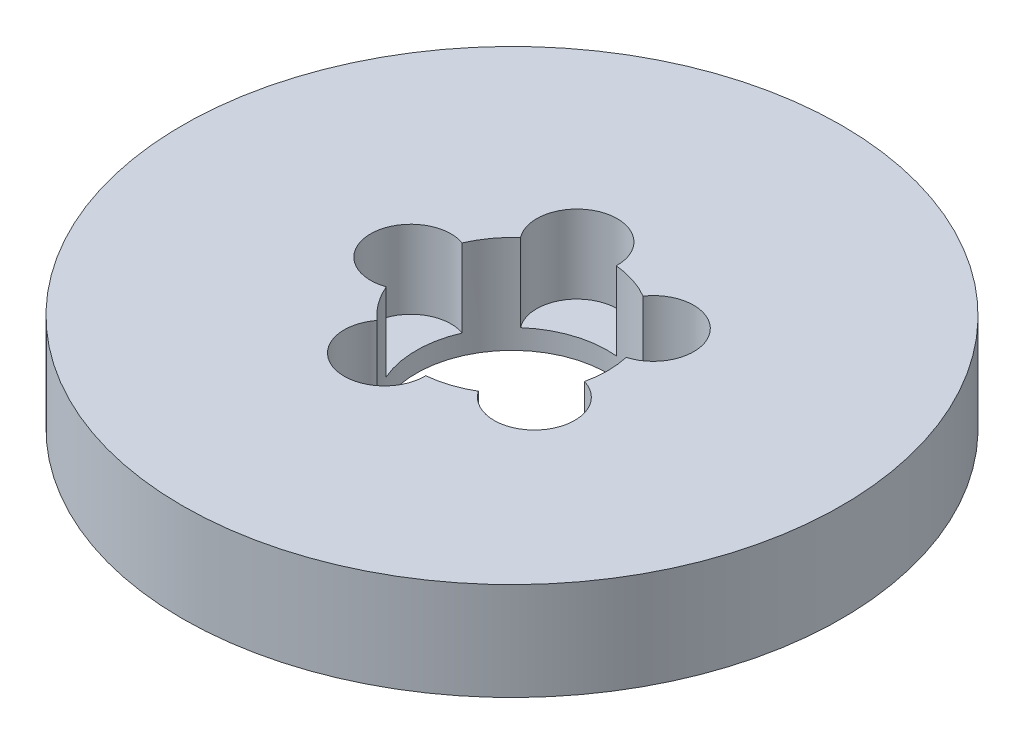
ISO-10303-21;
HEADER;
FILE_DESCRIPTION(('STEP AP214'),'2;1');
FILE_NAME('part.step','',(''),(''),'','','');
FILE_SCHEMA(('AUTOMOTIVE_DESIGN { 1 0 10303 214 1 1 1 1 }'));
ENDSEC;
DATA;
#1=APPLICATION_CONTEXT('core data for automotive mechanical design processes');
#2=APPLICATION_PROTOCOL_DEFINITION('international standard','automotive_design',2000,#1);
#3=PRODUCT_CONTEXT('',#1,'mechanical');
#4=PRODUCT('Part','Part','',(#3));
#5=PRODUCT_RELATED_PRODUCT_CATEGORY('part','',(#4));
#6=PRODUCT_DEFINITION_FORMATION('','',#4);
#7=PRODUCT_DEFINITION_CONTEXT('part definition',#1,'design');
#8=PRODUCT_DEFINITION('design','',#6,#7);
#9=PRODUCT_DEFINITION_SHAPE('','',#8);
#10=(LENGTH_UNIT() NAMED_UNIT(*) SI_UNIT(.MILLI.,.METRE.));
#11=(NAMED_UNIT(*) PLANE_ANGLE_UNIT() SI_UNIT($,.RADIAN.));
#12=(NAMED_UNIT(*) SI_UNIT($,.STERADIAN.) SOLID_ANGLE_UNIT());
#13=UNCERTAINTY_MEASURE_WITH_UNIT(LENGTH_MEASURE(1.E-05),#10,'distance_accuracy_value','');
#14=(GEOMETRIC_REPRESENTATION_CONTEXT(3) GLOBAL_UNCERTAINTY_ASSIGNED_CONTEXT((#13)) GLOBAL_UNIT_ASSIGNED_CONTEXT((#10,
#11,#12)) REPRESENTATION_CONTEXT('',''));
#15=CARTESIAN_POINT('',(0.,0.,0.));
#16=DIRECTION('',(0.,0.,1.));
#17=DIRECTION('',(1.,0.,0.));
#18=AXIS2_PLACEMENT_3D('',#15,#16,#17);
#19=CARTESIAN_POINT('',(0.,23.,0.));
#20=DIRECTION('',(0.,-1.,0.));
#21=DIRECTION('',(0.,0.,-1.));
#22=AXIS2_PLACEMENT_3D('',#19,#20,#21);
#23=CYLINDRICAL_SURFACE('',#22,77.5);
#24=CARTESIAN_POINT('',(0.,23.,0.));
#25=DIRECTION('',(0.,1.,0.));
#26=DIRECTION('',(0.,0.,1.));
#27=AXIS2_PLACEMENT_3D('',#24,#25,#26);
#28=CIRCLE('',#27,77.5);
#29=CARTESIAN_POINT('',(0.,23.,77.5));
#30=VERTEX_POINT('',#29);
#31=EDGE_CURVE('E157',#30,#30,#28,.T.);
#32=ORIENTED_EDGE('',*,*,#31,.F.);
#33=EDGE_LOOP('',(#32));
#34=FACE_BOUND('',#33,.T.);
#35=CARTESIAN_POINT('',(0.,0.,0.));
#36=DIRECTION('',(0.,1.,0.));
#37=DIRECTION('',(0.,0.,1.));
#38=AXIS2_PLACEMENT_3D('',#35,#36,#37);
#39=CIRCLE('',#38,77.5);
#40=CARTESIAN_POINT('',(0.,0.,77.5));
#41=VERTEX_POINT('',#40);
#42=EDGE_CURVE('E150',#41,#41,#39,.T.);
#43=ORIENTED_EDGE('',*,*,#42,.T.);
#44=EDGE_LOOP('',(#43));
#45=FACE_BOUND('',#44,.T.);
#46=ADVANCED_FACE('F39',(#34,#45),#23,.T.);
#47=CARTESIAN_POINT('',(0.,23.,0.));
#48=DIRECTION('',(0.,1.,0.));
#49=DIRECTION('',(0.,0.,1.));
#50=AXIS2_PLACEMENT_3D('',#47,#48,#49);
#51=PLANE('',#50);
#52=CARTESIAN_POINT('',(-7.3542074462386,23.,-22.6339231862593));
#53=DIRECTION('',(0.,1.,0.));
#54=DIRECTION('',(-0.95105651629515,0.,0.309016994374958));
#55=AXIS2_PLACEMENT_3D('',#52,#53,#54);
#56=CIRCLE('',#55,9.47849117084988);
#57=CARTESIAN_POINT('',(2.12139106793687,23.,-22.3997700866968));
#58=VERTEX_POINT('',#57);
#59=CARTESIAN_POINT('',(-14.882495937379,23.,-16.8748722861507));
#60=VERTEX_POINT('',#59);
#61=EDGE_CURVE('E194',#58,#60,#56,.T.);
#62=ORIENTED_EDGE('',*,*,#61,.F.);
#63=CARTESIAN_POINT('',(0.,23.,0.));
#64=DIRECTION('',(0.,1.,0.));
#65=DIRECTION('',(0.,0.,1.));
#66=AXIS2_PLACEMENT_3D('',#63,#64,#65);
#67=CIRCLE('',#66,22.5);
#68=CARTESIAN_POINT('',(11.450013086026,23.,-19.3687170543078));
#69=VERTEX_POINT('',#68);
#70=EDGE_CURVE('E147',#69,#58,#67,.T.);
#71=ORIENTED_EDGE('',*,*,#70,.F.);
#72=CARTESIAN_POINT('',(19.2535650545694,23.,-13.9885338278628));
#73=DIRECTION('',(0.,1.,0.));
#74=DIRECTION('',(-0.58778525229248,0.,-0.809016994374942));
#75=AXIS2_PLACEMENT_3D('',#72,#73,#74);
#76=CIRCLE('',#75,9.47849117084988);
#77=CARTESIAN_POINT('',(21.958993196174,23.,-4.90434682810916));
#78=VERTEX_POINT('',#77);
#79=EDGE_CURVE('E254',#78,#69,#76,.T.);
#80=ORIENTED_EDGE('',*,*,#79,.F.);
#81=CARTESIAN_POINT('',(21.9589931961741,23.,4.90434682810884));
#82=VERTEX_POINT('',#81);
#83=EDGE_CURVE('E144',#82,#78,#67,.T.);
#84=ORIENTED_EDGE('',*,*,#83,.F.);
#85=CARTESIAN_POINT('',(19.2535650545696,23.,13.9885338278625));
#86=DIRECTION('',(0.,1.,0.));
#87=DIRECTION('',(0.587785252292469,0.,-0.809016994374951));
#88=AXIS2_PLACEMENT_3D('',#85,#86,#87);
#89=CIRCLE('',#88,9.47849117084988);
#90=CARTESIAN_POINT('',(11.4500130860262,23.,19.3687170543077));
#91=VERTEX_POINT('',#90);
#92=EDGE_CURVE('E141',#91,#82,#89,.T.);
#93=ORIENTED_EDGE('',*,*,#92,.F.);
#94=CARTESIAN_POINT('',(2.12139106793718,23.,22.3997700866968));
#95=VERTEX_POINT('',#94);
#96=EDGE_CURVE('E134',#95,#91,#67,.T.);
#97=ORIENTED_EDGE('',*,*,#96,.F.);
#98=CARTESIAN_POINT('',(-7.35420744623828,23.,22.6339231862594));
#99=DIRECTION('',(0.,1.,0.));
#100=DIRECTION('',(0.951056516295155,0.,0.309016994374945));
#101=AXIS2_PLACEMENT_3D('',#98,#99,#100);
#102=CIRCLE('',#101,9.47849117084988);
#103=CARTESIAN_POINT('',(-14.8824959373788,23.,16.8748722861509));
#104=VERTEX_POINT('',#103);
#105=EDGE_CURVE('E111',#104,#95,#102,.T.);
#106=ORIENTED_EDGE('',*,*,#105,.F.);
#107=CARTESIAN_POINT('',(-20.6479014127585,23.,8.93947242565283));
#108=VERTEX_POINT('',#107);
#109=EDGE_CURVE('E145',#108,#104,#67,.T.);
#110=ORIENTED_EDGE('',*,*,#109,.F.);
#111=CARTESIAN_POINT('',(-23.7987152166624,23.,0.));
#112=DIRECTION('',(0.,1.,0.));
#113=DIRECTION('',(0.,0.,1.));
#114=AXIS2_PLACEMENT_3D('',#111,#112,#113);
#115=CIRCLE('',#114,9.47849117084988);
#116=CARTESIAN_POINT('',(-20.6479014127585,23.,-8.93947242565283));
#117=VERTEX_POINT('',#116);
#118=EDGE_CURVE('E153',#117,#108,#115,.T.);
#119=ORIENTED_EDGE('',*,*,#118,.F.);
#120=EDGE_CURVE('E146',#60,#117,#67,.T.);
#121=ORIENTED_EDGE('',*,*,#120,.F.);
#122=EDGE_LOOP('',(#62,#71,#80,#84,#93,#97,#106,#110,#119,#121));
#123=FACE_BOUND('',#122,.T.);
#124=ORIENTED_EDGE('',*,*,#31,.T.);
#125=EDGE_LOOP('',(#124));
#126=FACE_BOUND('',#125,.T.);
#127=ADVANCED_FACE('F139',(#123,#126),#51,.T.);
#128=CARTESIAN_POINT('',(0.,0.,0.));
#129=DIRECTION('',(0.,1.,0.));
#130=DIRECTION('',(0.,0.,1.));
#131=AXIS2_PLACEMENT_3D('',#128,#129,#130);
#132=PLANE('',#131);
#133=CARTESIAN_POINT('',(0.,0.,0.));
#134=DIRECTION('',(0.,1.,0.));
#135=DIRECTION('',(0.,0.,1.));
#136=AXIS2_PLACEMENT_3D('',#133,#134,#135);
#137=CIRCLE('',#136,22.5);
#138=CARTESIAN_POINT('',(0.,0.,22.5));
#139=VERTEX_POINT('',#138);
#140=EDGE_CURVE('E154',#139,#139,#137,.T.);
#141=ORIENTED_EDGE('',*,*,#140,.T.);
#142=EDGE_LOOP('',(#141));
#143=FACE_BOUND('',#142,.T.);
#144=ORIENTED_EDGE('',*,*,#42,.F.);
#145=EDGE_LOOP('',(#144));
#146=FACE_BOUND('',#145,.T.);
#147=ADVANCED_FACE('F213',(#143,#146),#132,.F.);
#148=CARTESIAN_POINT('',(0.,23.,0.));
#149=DIRECTION('',(0.,-1.,0.));
#150=DIRECTION('',(0.,0.,-1.));
#151=AXIS2_PLACEMENT_3D('',#148,#149,#150);
#152=CYLINDRICAL_SURFACE('',#151,22.5);
#153=DIRECTION('',(0.,1.,0.));
#154=VECTOR('',#153,1.);
#155=CARTESIAN_POINT('',(2.12139106793687,13.8272696008629,-22.3997700866968));
#156=LINE('',#155,#154);
#157=CARTESIAN_POINT('',(2.12139106793687,4.6545392017258,-22.3997700866968));
#158=VERTEX_POINT('',#157);
#159=EDGE_CURVE('E11',#158,#58,#156,.T.);
#160=ORIENTED_EDGE('',*,*,#159,.F.);
#161=CARTESIAN_POINT('',(0.,4.6545392017258,0.));
#162=DIRECTION('',(0.,1.,0.));
#163=DIRECTION('',(0.,0.,1.));
#164=AXIS2_PLACEMENT_3D('',#161,#162,#163);
#165=CIRCLE('',#164,22.5);
#166=CARTESIAN_POINT('',(-14.882495937379,4.6545392017258,-16.8748722861507));
#167=VERTEX_POINT('',#166);
#168=EDGE_CURVE('E189',#158,#167,#165,.T.);
#169=ORIENTED_EDGE('',*,*,#168,.T.);
#170=DIRECTION('',(0.,1.,0.));
#171=VECTOR('',#170,1.);
#172=CARTESIAN_POINT('',(-14.882495937379,13.8272696008629,-16.8748722861507));
#173=LINE('',#172,#171);
#174=EDGE_CURVE('E46',#60,#167,#173,.F.);
#175=ORIENTED_EDGE('',*,*,#174,.F.);
#176=ORIENTED_EDGE('',*,*,#120,.T.);
#177=DIRECTION('',(0.,1.,0.));
#178=VECTOR('',#177,1.);
#179=CARTESIAN_POINT('',(-20.6479014127585,13.8272696008629,-8.93947242565283));
#180=LINE('',#179,#178);
#181=CARTESIAN_POINT('',(-20.6479014127585,4.6545392017258,-8.93947242565283));
#182=VERTEX_POINT('',#181);
#183=EDGE_CURVE('E168',#182,#117,#180,.T.);
#184=ORIENTED_EDGE('',*,*,#183,.F.);
#185=CARTESIAN_POINT('',(0.,4.6545392017258,0.));
#186=DIRECTION('',(0.,1.,0.));
#187=DIRECTION('',(0.,0.,1.));
#188=AXIS2_PLACEMENT_3D('',#185,#186,#187);
#189=CIRCLE('',#188,22.5);
#190=CARTESIAN_POINT('',(-20.6479014127585,4.6545392017258,8.93947242565283));
#191=VERTEX_POINT('',#190);
#192=EDGE_CURVE('E165',#182,#191,#189,.T.);
#193=ORIENTED_EDGE('',*,*,#192,.T.);
#194=DIRECTION('',(0.,1.,0.));
#195=VECTOR('',#194,1.);
#196=CARTESIAN_POINT('',(-20.6479014127585,13.8272696008629,8.93947242565283));
#197=LINE('',#196,#195);
#198=EDGE_CURVE('E170',#108,#191,#197,.F.);
#199=ORIENTED_EDGE('',*,*,#198,.F.);
#200=ORIENTED_EDGE('',*,*,#109,.T.);
#201=DIRECTION('',(0.,1.,0.));
#202=VECTOR('',#201,1.);
#203=CARTESIAN_POINT('',(-14.8824959373788,13.8272696008629,16.8748722861509));
#204=LINE('',#203,#202);
#205=CARTESIAN_POINT('',(-14.8824959373788,4.6545392017258,16.8748722861509));
#206=VERTEX_POINT('',#205);
#207=EDGE_CURVE('E121',#206,#104,#204,.T.);
#208=ORIENTED_EDGE('',*,*,#207,.F.);
#209=CARTESIAN_POINT('',(0.,4.6545392017258,0.));
#210=DIRECTION('',(0.,1.,0.));
#211=DIRECTION('',(0.,0.,1.));
#212=AXIS2_PLACEMENT_3D('',#209,#210,#211);
#213=CIRCLE('',#212,22.5);
#214=CARTESIAN_POINT('',(2.12139106793718,4.6545392017258,22.3997700866968));
#215=VERTEX_POINT('',#214);
#216=EDGE_CURVE('E136',#206,#215,#213,.T.);
#217=ORIENTED_EDGE('',*,*,#216,.T.);
#218=DIRECTION('',(0.,1.,0.));
#219=VECTOR('',#218,1.);
#220=CARTESIAN_POINT('',(2.12139106793718,13.8272696008629,22.3997700866968));
#221=LINE('',#220,#219);
#222=EDGE_CURVE('E117',#95,#215,#221,.F.);
#223=ORIENTED_EDGE('',*,*,#222,.F.);
#224=ORIENTED_EDGE('',*,*,#96,.T.);
#225=DIRECTION('',(0.,1.,0.));
#226=VECTOR('',#225,1.);
#227=CARTESIAN_POINT('',(11.4500130860262,13.8272696008629,19.3687170543077));
#228=LINE('',#227,#226);
#229=CARTESIAN_POINT('',(11.4500130860262,4.6545392017258,19.3687170543077));
#230=VERTEX_POINT('',#229);
#231=EDGE_CURVE('E182',#230,#91,#228,.T.);
#232=ORIENTED_EDGE('',*,*,#231,.F.);
#233=CARTESIAN_POINT('',(0.,4.6545392017258,0.));
#234=DIRECTION('',(0.,1.,0.));
#235=DIRECTION('',(0.,0.,1.));
#236=AXIS2_PLACEMENT_3D('',#233,#234,#235);
#237=CIRCLE('',#236,22.5);
#238=CARTESIAN_POINT('',(21.9589931961741,4.6545392017258,4.90434682810884));
#239=VERTEX_POINT('',#238);
#240=EDGE_CURVE('E174',#230,#239,#237,.T.);
#241=ORIENTED_EDGE('',*,*,#240,.T.);
#242=DIRECTION('',(0.,1.,0.));
#243=VECTOR('',#242,1.);
#244=CARTESIAN_POINT('',(21.9589931961741,13.8272696008629,4.90434682810884));
#245=LINE('',#244,#243);
#246=EDGE_CURVE('E177',#82,#239,#245,.F.);
#247=ORIENTED_EDGE('',*,*,#246,.F.);
#248=ORIENTED_EDGE('',*,*,#83,.T.);
#249=DIRECTION('',(0.,1.,0.));
#250=VECTOR('',#249,1.);
#251=CARTESIAN_POINT('',(21.958993196174,13.8272696008629,-4.90434682810916));
#252=LINE('',#251,#250);
#253=CARTESIAN_POINT('',(21.958993196174,4.6545392017258,-4.90434682810916));
#254=VERTEX_POINT('',#253);
#255=EDGE_CURVE('E187',#254,#78,#252,.T.);
#256=ORIENTED_EDGE('',*,*,#255,.F.);
#257=CARTESIAN_POINT('',(0.,4.6545392017258,0.));
#258=DIRECTION('',(0.,1.,0.));
#259=DIRECTION('',(0.,0.,1.));
#260=AXIS2_PLACEMENT_3D('',#257,#258,#259);
#261=CIRCLE('',#260,22.5);
#262=CARTESIAN_POINT('',(11.450013086026,4.6545392017258,-19.3687170543078));
#263=VERTEX_POINT('',#262);
#264=EDGE_CURVE('E181',#254,#263,#261,.T.);
#265=ORIENTED_EDGE('',*,*,#264,.T.);
#266=DIRECTION('',(0.,1.,0.));
#267=VECTOR('',#266,1.);
#268=CARTESIAN_POINT('',(11.450013086026,13.8272696008629,-19.3687170543078));
#269=LINE('',#268,#267);
#270=EDGE_CURVE('E186',#69,#263,#269,.F.);
#271=ORIENTED_EDGE('',*,*,#270,.F.);
#272=ORIENTED_EDGE('',*,*,#70,.T.);
#273=EDGE_LOOP('',(#160,#169,#175,#176,#184,#193,#199,#200,#208,#217,#223,#224,#232,#241,#247,
#248,#256,#265,#271,#272));
#274=FACE_BOUND('',#273,.T.);
#275=ORIENTED_EDGE('',*,*,#140,.F.);
#276=EDGE_LOOP('',(#275));
#277=FACE_BOUND('',#276,.T.);
#278=ADVANCED_FACE('F135',(#274,#277),#152,.F.);
#279=CARTESIAN_POINT('',(-23.7987152166624,4.6545392017258,0.));
#280=DIRECTION('',(0.,1.,0.));
#281=DIRECTION('',(0.,0.,1.));
#282=AXIS2_PLACEMENT_3D('',#279,#280,#281);
#283=CYLINDRICAL_SURFACE('',#282,9.47849117084988);
#284=ORIENTED_EDGE('',*,*,#183,.T.);
#285=ORIENTED_EDGE('',*,*,#118,.T.);
#286=ORIENTED_EDGE('',*,*,#198,.T.);
#287=CARTESIAN_POINT('',(-23.7987152166624,4.6545392017258,0.));
#288=DIRECTION('',(0.,1.,0.));
#289=DIRECTION('',(0.,0.,1.));
#290=AXIS2_PLACEMENT_3D('',#287,#288,#289);
#291=CIRCLE('',#290,9.47849117084988);
#292=EDGE_CURVE('E158',#182,#191,#291,.T.);
#293=ORIENTED_EDGE('',*,*,#292,.F.);
#294=EDGE_LOOP('',(#284,#285,#286,#293));
#295=FACE_BOUND('',#294,.T.);
#296=ADVANCED_FACE('F221',(#295),#283,.F.);
#297=CARTESIAN_POINT('',(-23.7987152166624,4.6545392017258,0.));
#298=DIRECTION('',(0.,1.,0.));
#299=DIRECTION('',(0.,0.,1.));
#300=AXIS2_PLACEMENT_3D('',#297,#298,#299);
#301=PLANE('',#300);
#302=ORIENTED_EDGE('',*,*,#292,.T.);
#303=ORIENTED_EDGE('',*,*,#192,.F.);
#304=EDGE_LOOP('',(#302,#303));
#305=FACE_BOUND('',#304,.T.);
#306=ADVANCED_FACE('F227',(#305),#301,.T.);
#307=CARTESIAN_POINT('',(-7.35420744623828,4.6545392017258,22.6339231862594));
#308=DIRECTION('',(0.,1.,0.));
#309=DIRECTION('',(0.,0.,1.));
#310=AXIS2_PLACEMENT_3D('',#307,#308,#309);
#311=CYLINDRICAL_SURFACE('',#310,9.47849117084988);
#312=ORIENTED_EDGE('',*,*,#207,.T.);
#313=ORIENTED_EDGE('',*,*,#105,.T.);
#314=ORIENTED_EDGE('',*,*,#222,.T.);
#315=CARTESIAN_POINT('',(-7.35420744623828,4.6545392017258,22.6339231862594));
#316=DIRECTION('',(0.,1.,0.));
#317=DIRECTION('',(0.951056516295155,0.,0.309016994374945));
#318=AXIS2_PLACEMENT_3D('',#315,#316,#317);
#319=CIRCLE('',#318,9.47849117084988);
#320=EDGE_CURVE('E127',#206,#215,#319,.T.);
#321=ORIENTED_EDGE('',*,*,#320,.F.);
#322=EDGE_LOOP('',(#312,#313,#314,#321));
#323=FACE_BOUND('',#322,.T.);
#324=ADVANCED_FACE('F116',(#323),#311,.F.);
#325=CARTESIAN_POINT('',(-7.35420744623828,4.6545392017258,22.6339231862594));
#326=DIRECTION('',(0.,1.,0.));
#327=DIRECTION('',(0.951056516295155,0.,0.309016994374945));
#328=AXIS2_PLACEMENT_3D('',#325,#326,#327);
#329=PLANE('',#328);
#330=ORIENTED_EDGE('',*,*,#320,.T.);
#331=ORIENTED_EDGE('',*,*,#216,.F.);
#332=EDGE_LOOP('',(#330,#331));
#333=FACE_BOUND('',#332,.T.);
#334=ADVANCED_FACE('F234',(#333),#329,.T.);
#335=CARTESIAN_POINT('',(19.2535650545696,4.6545392017258,13.9885338278625));
#336=DIRECTION('',(0.,1.,0.));
#337=DIRECTION('',(0.,0.,1.));
#338=AXIS2_PLACEMENT_3D('',#335,#336,#337);
#339=CYLINDRICAL_SURFACE('',#338,9.47849117084988);
#340=ORIENTED_EDGE('',*,*,#231,.T.);
#341=ORIENTED_EDGE('',*,*,#92,.T.);
#342=ORIENTED_EDGE('',*,*,#246,.T.);
#343=CARTESIAN_POINT('',(19.2535650545696,4.6545392017258,13.9885338278625));
#344=DIRECTION('',(0.,1.,0.));
#345=DIRECTION('',(0.587785252292469,0.,-0.809016994374951));
#346=AXIS2_PLACEMENT_3D('',#343,#344,#345);
#347=CIRCLE('',#346,9.47849117084988);
#348=EDGE_CURVE('E130',#230,#239,#347,.T.);
#349=ORIENTED_EDGE('',*,*,#348,.F.);
#350=EDGE_LOOP('',(#340,#341,#342,#349));
#351=FACE_BOUND('',#350,.T.);
#352=ADVANCED_FACE('F240',(#351),#339,.F.);
#353=CARTESIAN_POINT('',(19.2535650545696,4.6545392017258,13.9885338278625));
#354=DIRECTION('',(0.,1.,0.));
#355=DIRECTION('',(0.587785252292469,0.,-0.809016994374951));
#356=AXIS2_PLACEMENT_3D('',#353,#354,#355);
#357=PLANE('',#356);
#358=ORIENTED_EDGE('',*,*,#348,.T.);
#359=ORIENTED_EDGE('',*,*,#240,.F.);
#360=EDGE_LOOP('',(#358,#359));
#361=FACE_BOUND('',#360,.T.);
#362=ADVANCED_FACE('F245',(#361),#357,.T.);
#363=CARTESIAN_POINT('',(19.2535650545694,4.6545392017258,-13.9885338278628));
#364=DIRECTION('',(0.,1.,0.));
#365=DIRECTION('',(0.,0.,1.));
#366=AXIS2_PLACEMENT_3D('',#363,#364,#365);
#367=CYLINDRICAL_SURFACE('',#366,9.47849117084988);
#368=ORIENTED_EDGE('',*,*,#255,.T.);
#369=ORIENTED_EDGE('',*,*,#79,.T.);
#370=ORIENTED_EDGE('',*,*,#270,.T.);
#371=CARTESIAN_POINT('',(19.2535650545694,4.6545392017258,-13.9885338278628));
#372=DIRECTION('',(0.,1.,0.));
#373=DIRECTION('',(-0.58778525229248,0.,-0.809016994374942));
#374=AXIS2_PLACEMENT_3D('',#371,#372,#373);
#375=CIRCLE('',#374,9.47849117084988);
#376=EDGE_CURVE('E56',#254,#263,#375,.T.);
#377=ORIENTED_EDGE('',*,*,#376,.F.);
#378=EDGE_LOOP('',(#368,#369,#370,#377));
#379=FACE_BOUND('',#378,.T.);
#380=ADVANCED_FACE('F266',(#379),#367,.F.);
#381=CARTESIAN_POINT('',(19.2535650545694,4.6545392017258,-13.9885338278628));
#382=DIRECTION('',(0.,1.,0.));
#383=DIRECTION('',(-0.58778525229248,0.,-0.809016994374942));
#384=AXIS2_PLACEMENT_3D('',#381,#382,#383);
#385=PLANE('',#384);
#386=ORIENTED_EDGE('',*,*,#376,.T.);
#387=ORIENTED_EDGE('',*,*,#264,.F.);
#388=EDGE_LOOP('',(#386,#387));
#389=FACE_BOUND('',#388,.T.);
#390=ADVANCED_FACE('F204',(#389),#385,.T.);
#391=CARTESIAN_POINT('',(-7.3542074462386,4.6545392017258,-22.6339231862593));
#392=DIRECTION('',(0.,1.,0.));
#393=DIRECTION('',(0.,0.,1.));
#394=AXIS2_PLACEMENT_3D('',#391,#392,#393);
#395=CYLINDRICAL_SURFACE('',#394,9.47849117084988);
#396=ORIENTED_EDGE('',*,*,#159,.T.);
#397=ORIENTED_EDGE('',*,*,#61,.T.);
#398=ORIENTED_EDGE('',*,*,#174,.T.);
#399=CARTESIAN_POINT('',(-7.3542074462386,4.6545392017258,-22.6339231862593));
#400=DIRECTION('',(0.,1.,0.));
#401=DIRECTION('',(-0.95105651629515,0.,0.309016994374958));
#402=AXIS2_PLACEMENT_3D('',#399,#400,#401);
#403=CIRCLE('',#402,9.47849117084988);
#404=EDGE_CURVE('E55',#158,#167,#403,.T.);
#405=ORIENTED_EDGE('',*,*,#404,.F.);
#406=EDGE_LOOP('',(#396,#397,#398,#405));
#407=FACE_BOUND('',#406,.T.);
#408=ADVANCED_FACE('F193',(#407),#395,.F.);
#409=CARTESIAN_POINT('',(-7.3542074462386,4.6545392017258,-22.6339231862593));
#410=DIRECTION('',(0.,1.,0.));
#411=DIRECTION('',(-0.95105651629515,0.,0.309016994374958));
#412=AXIS2_PLACEMENT_3D('',#409,#410,#411);
#413=PLANE('',#412);
#414=ORIENTED_EDGE('',*,*,#404,.T.);
#415=ORIENTED_EDGE('',*,*,#168,.F.);
#416=EDGE_LOOP('',(#414,#415));
#417=FACE_BOUND('',#416,.T.);
#418=ADVANCED_FACE('F196',(#417),#413,.T.);
#419=CLOSED_SHELL('',(#46,#127,#147,#278,#296,#306,#324,#334,#352,#362,#380,#390,#408,#418));
#420=MANIFOLD_SOLID_BREP('B2',#419);
#421=ADVANCED_BREP_SHAPE_REPRESENTATION('',(#18,#420),#14);
#422=SHAPE_DEFINITION_REPRESENTATION(#9,#421);
ENDSEC;
END-ISO-10303-21;
